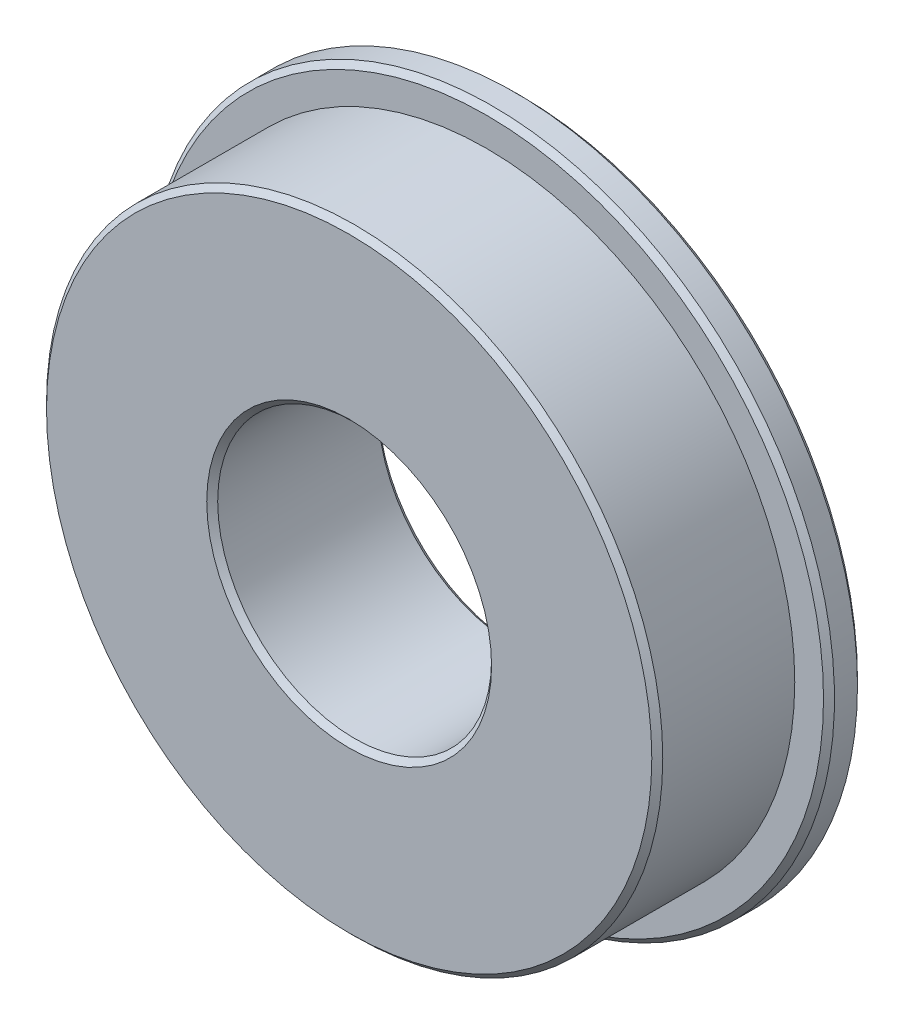
ISO-10303-21;
HEADER;
FILE_DESCRIPTION(('STEP AP214'),'2;1');
FILE_NAME('part.step','',(''),(''),'','','');
FILE_SCHEMA(('AUTOMOTIVE_DESIGN { 1 0 10303 214 1 1 1 1 }'));
ENDSEC;
DATA;
#1=APPLICATION_CONTEXT('core data for automotive mechanical design processes');
#2=APPLICATION_PROTOCOL_DEFINITION('international standard','automotive_design',2000,#1);
#3=PRODUCT_CONTEXT('',#1,'mechanical');
#4=PRODUCT('Part','Part','',(#3));
#5=PRODUCT_RELATED_PRODUCT_CATEGORY('part','',(#4));
#6=PRODUCT_DEFINITION_FORMATION('','',#4);
#7=PRODUCT_DEFINITION_CONTEXT('part definition',#1,'design');
#8=PRODUCT_DEFINITION('design','',#6,#7);
#9=PRODUCT_DEFINITION_SHAPE('','',#8);
#10=(LENGTH_UNIT() NAMED_UNIT(*) SI_UNIT(.MILLI.,.METRE.));
#11=(NAMED_UNIT(*) PLANE_ANGLE_UNIT() SI_UNIT($,.RADIAN.));
#12=(NAMED_UNIT(*) SI_UNIT($,.STERADIAN.) SOLID_ANGLE_UNIT());
#13=UNCERTAINTY_MEASURE_WITH_UNIT(LENGTH_MEASURE(1.E-05),#10,'distance_accuracy_value','');
#14=(GEOMETRIC_REPRESENTATION_CONTEXT(3) GLOBAL_UNCERTAINTY_ASSIGNED_CONTEXT((#13)) GLOBAL_UNIT_ASSIGNED_CONTEXT((#10,
#11,#12)) REPRESENTATION_CONTEXT('',''));
#15=CARTESIAN_POINT('',(0.,0.,0.));
#16=DIRECTION('',(0.,0.,1.));
#17=DIRECTION('',(1.,0.,0.));
#18=AXIS2_PLACEMENT_3D('',#15,#16,#17);
#19=CARTESIAN_POINT('',(-8.86153846153846,6.04195804195805,7.69619999999998));
#20=DIRECTION('',(0.,0.,-1.));
#21=DIRECTION('',(0.,1.,0.));
#22=AXIS2_PLACEMENT_3D('',#19,#20,#21);
#23=CONICAL_SURFACE('',#22,14.2875,0.785398163397453);
#24=CARTESIAN_POINT('',(-8.86153846153846,6.04195804195805,7.6962));
#25=DIRECTION('',(0.,0.,-1.));
#26=DIRECTION('',(-1.,0.,0.));
#27=AXIS2_PLACEMENT_3D('',#24,#25,#26);
#28=CIRCLE('',#27,14.2875);
#29=CARTESIAN_POINT('',(-23.1490384615385,6.04195804195805,7.6962));
#30=VERTEX_POINT('',#29);
#31=EDGE_CURVE('E43',#30,#30,#28,.T.);
#32=ORIENTED_EDGE('',*,*,#31,.F.);
#33=EDGE_LOOP('',(#32));
#34=FACE_BOUND('',#33,.T.);
#35=CARTESIAN_POINT('',(-8.86153846153846,6.04195804195805,7.95019999999998));
#36=DIRECTION('',(0.,0.,-1.));
#37=DIRECTION('',(0.,1.,0.));
#38=AXIS2_PLACEMENT_3D('',#35,#36,#37);
#39=CIRCLE('',#38,14.0335);
#40=CARTESIAN_POINT('',(-8.86153846153846,20.0754580419581,7.95019999999998));
#41=VERTEX_POINT('',#40);
#42=EDGE_CURVE('E17',#41,#41,#39,.T.);
#43=ORIENTED_EDGE('',*,*,#42,.T.);
#44=EDGE_LOOP('',(#43));
#45=FACE_BOUND('',#44,.T.);
#46=ADVANCED_FACE('F14',(#34,#45),#23,.T.);
#47=CARTESIAN_POINT('',(-8.86153846153846,6.04195804195805,7.9502));
#48=DIRECTION('',(0.,0.,-1.));
#49=DIRECTION('',(-1.,0.,0.));
#50=AXIS2_PLACEMENT_3D('',#47,#48,#49);
#51=CYLINDRICAL_SURFACE('',#50,14.2875);
#52=CARTESIAN_POINT('',(-8.86153846153846,6.04195804195805,1.5748));
#53=DIRECTION('',(0.,0.,-1.));
#54=DIRECTION('',(-1.,0.,0.));
#55=AXIS2_PLACEMENT_3D('',#52,#53,#54);
#56=CIRCLE('',#55,14.2875);
#57=CARTESIAN_POINT('',(-23.1490384615385,6.04195804195805,1.5748));
#58=VERTEX_POINT('',#57);
#59=EDGE_CURVE('E38',#58,#58,#56,.F.);
#60=ORIENTED_EDGE('',*,*,#59,.T.);
#61=EDGE_LOOP('',(#60));
#62=FACE_BOUND('',#61,.T.);
#63=ORIENTED_EDGE('',*,*,#31,.T.);
#64=EDGE_LOOP('',(#63));
#65=FACE_BOUND('',#64,.T.);
#66=ADVANCED_FACE('F158',(#62,#65),#51,.T.);
#67=CARTESIAN_POINT('',(-8.86153846153846,6.04195804195805,7.9502));
#68=DIRECTION('',(0.,0.,-1.));
#69=DIRECTION('',(-1.,0.,0.));
#70=AXIS2_PLACEMENT_3D('',#67,#68,#69);
#71=PLANE('',#70);
#72=ORIENTED_EDGE('',*,*,#42,.F.);
#73=EDGE_LOOP('',(#72));
#74=FACE_BOUND('',#73,.T.);
#75=CARTESIAN_POINT('',(-8.86153846153846,6.04195804195805,7.95020000003888));
#76=DIRECTION('',(0.,0.,1.));
#77=DIRECTION('',(1.,0.,0.));
#78=AXIS2_PLACEMENT_3D('',#75,#76,#77);
#79=CIRCLE('',#78,6.60399999998916);
#80=CARTESIAN_POINT('',(-2.2575384615493,6.04195804195805,7.95020000003888));
#81=VERTEX_POINT('',#80);
#82=EDGE_CURVE('E36',#81,#81,#79,.F.);
#83=ORIENTED_EDGE('',*,*,#82,.T.);
#84=EDGE_LOOP('',(#83));
#85=FACE_BOUND('',#84,.T.);
#86=ADVANCED_FACE('F148',(#74,#85),#71,.F.);
#87=CARTESIAN_POINT('',(-8.86153846153846,6.04195804195805,1.5748));
#88=DIRECTION('',(0.,0.,-1.));
#89=DIRECTION('',(-1.,0.,0.));
#90=AXIS2_PLACEMENT_3D('',#87,#88,#89);
#91=PLANE('',#90);
#92=ORIENTED_EDGE('',*,*,#59,.F.);
#93=EDGE_LOOP('',(#92));
#94=FACE_BOUND('',#93,.T.);
#95=CARTESIAN_POINT('',(-8.86153846153846,6.04195804195805,1.57479999999998));
#96=DIRECTION('',(0.,0.,-1.));
#97=DIRECTION('',(-1.,0.,0.));
#98=AXIS2_PLACEMENT_3D('',#95,#96,#97);
#99=CIRCLE('',#98,15.621);
#100=CARTESIAN_POINT('',(-24.4825384615385,6.04195804195805,1.57479999999998));
#101=VERTEX_POINT('',#100);
#102=EDGE_CURVE('E32',#101,#101,#99,.T.);
#103=ORIENTED_EDGE('',*,*,#102,.F.);
#104=EDGE_LOOP('',(#103));
#105=FACE_BOUND('',#104,.T.);
#106=ADVANCED_FACE('F138',(#94,#105),#91,.F.);
#107=CARTESIAN_POINT('',(-8.86153846153846,6.04195804195805,7.95019999992519));
#108=DIRECTION('',(0.,0.,1.));
#109=DIRECTION('',(1.,0.,0.));
#110=AXIS2_PLACEMENT_3D('',#107,#108,#109);
#111=CONICAL_SURFACE('',#110,6.60399999987547,0.785398163397448);
#112=ORIENTED_EDGE('',*,*,#82,.F.);
#113=EDGE_LOOP('',(#112));
#114=FACE_BOUND('',#113,.T.);
#115=CARTESIAN_POINT('',(-8.86153846153846,6.04195804195805,7.6962));
#116=DIRECTION('',(0.,0.,-1.));
#117=DIRECTION('',(-1.,0.,0.));
#118=AXIS2_PLACEMENT_3D('',#115,#116,#117);
#119=CIRCLE('',#118,6.35);
#120=CARTESIAN_POINT('',(-15.2115384615385,6.04195804195805,7.6962));
#121=VERTEX_POINT('',#120);
#122=EDGE_CURVE('E35',#121,#121,#119,.T.);
#123=ORIENTED_EDGE('',*,*,#122,.T.);
#124=EDGE_LOOP('',(#123));
#125=FACE_BOUND('',#124,.T.);
#126=ADVANCED_FACE('F128',(#114,#125),#111,.F.);
#127=CARTESIAN_POINT('',(-8.86153846153846,6.04195804195805,1.32079999999998));
#128=DIRECTION('',(0.,0.,-1.));
#129=DIRECTION('',(-1.,0.,0.));
#130=AXIS2_PLACEMENT_3D('',#127,#128,#129);
#131=CONICAL_SURFACE('',#130,15.875,0.785398163397452);
#132=CARTESIAN_POINT('',(-8.86153846153846,6.04195804195805,1.3208));
#133=DIRECTION('',(0.,0.,-1.));
#134=DIRECTION('',(-1.,0.,0.));
#135=AXIS2_PLACEMENT_3D('',#132,#133,#134);
#136=CIRCLE('',#135,15.875);
#137=CARTESIAN_POINT('',(-24.7365384615385,6.04195804195805,1.3208));
#138=VERTEX_POINT('',#137);
#139=EDGE_CURVE('E54',#138,#138,#136,.T.);
#140=ORIENTED_EDGE('',*,*,#139,.F.);
#141=EDGE_LOOP('',(#140));
#142=FACE_BOUND('',#141,.T.);
#143=ORIENTED_EDGE('',*,*,#102,.T.);
#144=EDGE_LOOP('',(#143));
#145=FACE_BOUND('',#144,.T.);
#146=ADVANCED_FACE('F84',(#142,#145),#131,.T.);
#147=CARTESIAN_POINT('',(-8.86153846153846,6.04195804195805,1.5748));
#148=DIRECTION('',(0.,0.,-1.));
#149=DIRECTION('',(-1.,0.,0.));
#150=AXIS2_PLACEMENT_3D('',#147,#148,#149);
#151=CYLINDRICAL_SURFACE('',#150,6.35);
#152=CARTESIAN_POINT('',(-8.86153846153846,6.04195804195805,0.253999999927146));
#153=DIRECTION('',(0.,0.,-1.));
#154=DIRECTION('',(-1.,0.,0.));
#155=AXIS2_PLACEMENT_3D('',#152,#153,#154);
#156=CIRCLE('',#155,6.3499999999901);
#157=CARTESIAN_POINT('',(-15.2115384615286,6.04195804195805,0.253999999927146));
#158=VERTEX_POINT('',#157);
#159=EDGE_CURVE('E59',#158,#158,#156,.T.);
#160=ORIENTED_EDGE('',*,*,#159,.T.);
#161=EDGE_LOOP('',(#160));
#162=FACE_BOUND('',#161,.T.);
#163=ORIENTED_EDGE('',*,*,#122,.F.);
#164=EDGE_LOOP('',(#163));
#165=FACE_BOUND('',#164,.T.);
#166=ADVANCED_FACE('F74',(#162,#165),#151,.F.);
#167=CARTESIAN_POINT('',(-8.86153846153846,6.04195804195805,1.5748));
#168=DIRECTION('',(0.,0.,-1.));
#169=DIRECTION('',(-1.,0.,0.));
#170=AXIS2_PLACEMENT_3D('',#167,#168,#169);
#171=CYLINDRICAL_SURFACE('',#170,15.875);
#172=ORIENTED_EDGE('',*,*,#139,.T.);
#173=EDGE_LOOP('',(#172));
#174=FACE_BOUND('',#173,.T.);
#175=CARTESIAN_POINT('',(-8.86153846153846,6.04195804195805,0.254000000000016));
#176=DIRECTION('',(0.,0.,1.));
#177=DIRECTION('',(1.,0.,0.));
#178=AXIS2_PLACEMENT_3D('',#175,#176,#177);
#179=CIRCLE('',#178,15.875);
#180=CARTESIAN_POINT('',(7.01346153846156,6.04195804195805,0.254000000000018));
#181=VERTEX_POINT('',#180);
#182=EDGE_CURVE('E26',#181,#181,#179,.F.);
#183=ORIENTED_EDGE('',*,*,#182,.F.);
#184=EDGE_LOOP('',(#183));
#185=FACE_BOUND('',#184,.T.);
#186=ADVANCED_FACE('F71',(#174,#185),#171,.T.);
#187=CARTESIAN_POINT('',(-8.86153846153846,6.04195804195805,-5.6843418860808E-11));
#188=DIRECTION('',(0.,0.,-1.));
#189=DIRECTION('',(-1.,0.,0.));
#190=AXIS2_PLACEMENT_3D('',#187,#188,#189);
#191=CONICAL_SURFACE('',#190,6.60399999997409,0.785398163397448);
#192=ORIENTED_EDGE('',*,*,#159,.F.);
#193=EDGE_LOOP('',(#192));
#194=FACE_BOUND('',#193,.T.);
#195=CARTESIAN_POINT('',(-8.86153846153846,6.04195804195805,-5.6843418860808E-11));
#196=DIRECTION('',(0.,0.,-1.));
#197=DIRECTION('',(-1.,0.,0.));
#198=AXIS2_PLACEMENT_3D('',#195,#196,#197);
#199=CIRCLE('',#198,6.60399999997409);
#200=CARTESIAN_POINT('',(-15.4655384615126,6.04195804195805,-5.6843418860808E-11));
#201=VERTEX_POINT('',#200);
#202=EDGE_CURVE('E21',#201,#201,#199,.F.);
#203=ORIENTED_EDGE('',*,*,#202,.F.);
#204=EDGE_LOOP('',(#203));
#205=FACE_BOUND('',#204,.T.);
#206=ADVANCED_FACE('F73',(#194,#205),#191,.F.);
#207=CARTESIAN_POINT('',(-8.86153846153846,6.04195804195805,0.254000000000017));
#208=DIRECTION('',(0.,0.,1.));
#209=DIRECTION('',(0.,-1.,0.));
#210=AXIS2_PLACEMENT_3D('',#207,#208,#209);
#211=CONICAL_SURFACE('',#210,15.875,0.785398163397452);
#212=CARTESIAN_POINT('',(-8.86153846153846,6.04195804195805,0.));
#213=DIRECTION('',(0.,0.,1.));
#214=DIRECTION('',(0.,-1.,0.));
#215=AXIS2_PLACEMENT_3D('',#212,#213,#214);
#216=CIRCLE('',#215,15.621);
#217=CARTESIAN_POINT('',(-8.86153846153846,-9.57904195804197,0.));
#218=VERTEX_POINT('',#217);
#219=EDGE_CURVE('E10',#218,#218,#216,.F.);
#220=ORIENTED_EDGE('',*,*,#219,.F.);
#221=EDGE_LOOP('',(#220));
#222=FACE_BOUND('',#221,.T.);
#223=ORIENTED_EDGE('',*,*,#182,.T.);
#224=EDGE_LOOP('',(#223));
#225=FACE_BOUND('',#224,.T.);
#226=ADVANCED_FACE('F69',(#222,#225),#211,.T.);
#227=CARTESIAN_POINT('',(-8.86153846153846,6.04195804195805,0.));
#228=DIRECTION('',(0.,0.,-1.));
#229=DIRECTION('',(-1.,0.,0.));
#230=AXIS2_PLACEMENT_3D('',#227,#228,#229);
#231=PLANE('',#230);
#232=ORIENTED_EDGE('',*,*,#219,.T.);
#233=EDGE_LOOP('',(#232));
#234=FACE_BOUND('',#233,.T.);
#235=ORIENTED_EDGE('',*,*,#202,.T.);
#236=EDGE_LOOP('',(#235));
#237=FACE_BOUND('',#236,.T.);
#238=ADVANCED_FACE('F87',(#234,#237),#231,.T.);
#239=CLOSED_SHELL('',(#46,#66,#86,#106,#126,#146,#166,#186,#206,#226,#238));
#240=MANIFOLD_SOLID_BREP('B1',#239);
#241=ADVANCED_BREP_SHAPE_REPRESENTATION('',(#18,#240),#14);
#242=SHAPE_DEFINITION_REPRESENTATION(#9,#241);
ENDSEC;
END-ISO-10303-21;
